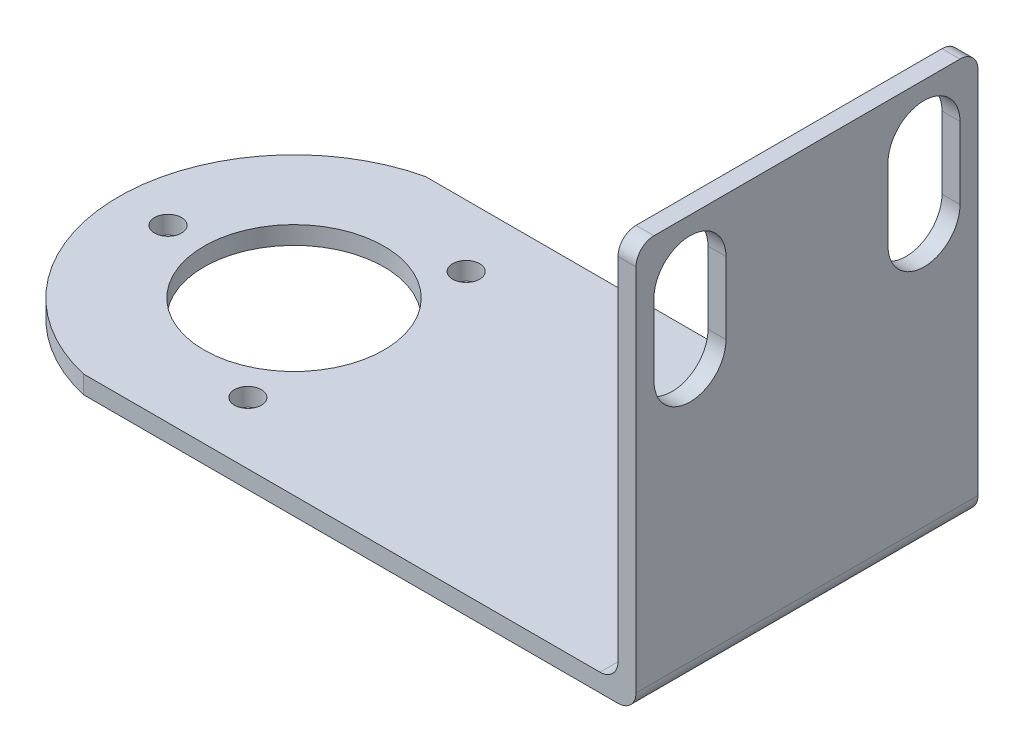
ISO-10303-21;
HEADER;
FILE_DESCRIPTION(('STEP AP214'),'2;1');
FILE_NAME('part.step','',(''),(''),'','','');
FILE_SCHEMA(('AUTOMOTIVE_DESIGN { 1 0 10303 214 1 1 1 1 }'));
ENDSEC;
DATA;
#1=APPLICATION_CONTEXT('core data for automotive mechanical design processes');
#2=APPLICATION_PROTOCOL_DEFINITION('international standard','automotive_design',2000,#1);
#3=PRODUCT_CONTEXT('',#1,'mechanical');
#4=PRODUCT('Part','Part','',(#3));
#5=PRODUCT_RELATED_PRODUCT_CATEGORY('part','',(#4));
#6=PRODUCT_DEFINITION_FORMATION('','',#4);
#7=PRODUCT_DEFINITION_CONTEXT('part definition',#1,'design');
#8=PRODUCT_DEFINITION('design','',#6,#7);
#9=PRODUCT_DEFINITION_SHAPE('','',#8);
#10=(LENGTH_UNIT() NAMED_UNIT(*) SI_UNIT(.MILLI.,.METRE.));
#11=(NAMED_UNIT(*) PLANE_ANGLE_UNIT() SI_UNIT($,.RADIAN.));
#12=(NAMED_UNIT(*) SI_UNIT($,.STERADIAN.) SOLID_ANGLE_UNIT());
#13=UNCERTAINTY_MEASURE_WITH_UNIT(LENGTH_MEASURE(1.E-05),#10,'distance_accuracy_value','');
#14=(GEOMETRIC_REPRESENTATION_CONTEXT(3) GLOBAL_UNCERTAINTY_ASSIGNED_CONTEXT((#13)) GLOBAL_UNIT_ASSIGNED_CONTEXT((#10,
#11,#12)) REPRESENTATION_CONTEXT('',''));
#15=CARTESIAN_POINT('',(0.,0.,0.));
#16=DIRECTION('',(0.,0.,1.));
#17=DIRECTION('',(1.,0.,0.));
#18=AXIS2_PLACEMENT_3D('',#15,#16,#17);
#19=CARTESIAN_POINT('',(0.,2.,-38.));
#20=DIRECTION('',(0.,0.,-1.));
#21=DIRECTION('',(-1.,0.,0.));
#22=AXIS2_PLACEMENT_3D('',#19,#20,#21);
#23=PLANE('',#22);
#24=DIRECTION('',(0.,-1.,0.));
#25=VECTOR('',#24,1.);
#26=CARTESIAN_POINT('',(59.3874821936961,45.,-38.));
#27=LINE('',#26,#25);
#28=CARTESIAN_POINT('',(59.3874821936961,43.,-38.));
#29=VERTEX_POINT('',#28);
#30=CARTESIAN_POINT('',(59.3874821936961,4.,-38.));
#31=VERTEX_POINT('',#30);
#32=EDGE_CURVE('E220',#29,#31,#27,.T.);
#33=ORIENTED_EDGE('',*,*,#32,.F.);
#34=DIRECTION('',(-1.,0.,0.));
#35=VECTOR('',#34,1.);
#36=CARTESIAN_POINT('',(0.,43.,-38.));
#37=LINE('',#36,#35);
#38=CARTESIAN_POINT('',(61.3874821936961,43.,-38.));
#39=VERTEX_POINT('',#38);
#40=EDGE_CURVE('E302',#29,#39,#37,.F.);
#41=ORIENTED_EDGE('',*,*,#40,.T.);
#42=DIRECTION('',(0.,-1.,0.));
#43=VECTOR('',#42,1.);
#44=CARTESIAN_POINT('',(61.3874821936961,2.,-38.));
#45=LINE('',#44,#43);
#46=CARTESIAN_POINT('',(61.3874821936961,2.,-38.));
#47=VERTEX_POINT('',#46);
#48=EDGE_CURVE('E246',#39,#47,#45,.T.);
#49=ORIENTED_EDGE('',*,*,#48,.T.);
#50=CARTESIAN_POINT('',(59.3874821936961,2.,-38.));
#51=DIRECTION('',(0.,0.,-1.));
#52=DIRECTION('',(-1.,0.,0.));
#53=AXIS2_PLACEMENT_3D('',#50,#51,#52);
#54=CIRCLE('',#53,2.);
#55=CARTESIAN_POINT('',(59.3874821936961,0.,-38.));
#56=VERTEX_POINT('',#55);
#57=EDGE_CURVE('E300',#47,#56,#54,.T.);
#58=ORIENTED_EDGE('',*,*,#57,.T.);
#59=DIRECTION('',(1.,0.,0.));
#60=VECTOR('',#59,1.);
#61=CARTESIAN_POINT('',(0.,0.,-38.));
#62=LINE('',#61,#60);
#63=CARTESIAN_POINT('',(0.,0.,-38.));
#64=VERTEX_POINT('',#63);
#65=EDGE_CURVE('E258',#64,#56,#62,.T.);
#66=ORIENTED_EDGE('',*,*,#65,.F.);
#67=DIRECTION('',(0.,-1.,0.));
#68=VECTOR('',#67,1.);
#69=CARTESIAN_POINT('',(0.,2.,-38.));
#70=LINE('',#69,#68);
#71=CARTESIAN_POINT('',(0.,2.,-38.));
#72=VERTEX_POINT('',#71);
#73=EDGE_CURVE('E274',#72,#64,#70,.T.);
#74=ORIENTED_EDGE('',*,*,#73,.F.);
#75=DIRECTION('',(1.,0.,0.));
#76=VECTOR('',#75,1.);
#77=CARTESIAN_POINT('',(0.,2.,-38.));
#78=LINE('',#77,#76);
#79=CARTESIAN_POINT('',(57.3874821936961,2.,-38.));
#80=VERTEX_POINT('',#79);
#81=EDGE_CURVE('E237',#72,#80,#78,.T.);
#82=ORIENTED_EDGE('',*,*,#81,.T.);
#83=CARTESIAN_POINT('',(57.3874821936961,4.,-38.));
#84=DIRECTION('',(0.,0.,-1.));
#85=DIRECTION('',(-1.,0.,0.));
#86=AXIS2_PLACEMENT_3D('',#83,#84,#85);
#87=CIRCLE('',#86,2.);
#88=EDGE_CURVE('E310',#80,#31,#87,.F.);
#89=ORIENTED_EDGE('',*,*,#88,.T.);
#90=EDGE_LOOP('',(#33,#41,#49,#58,#66,#74,#82,#89));
#91=FACE_BOUND('',#90,.T.);
#92=ADVANCED_FACE('F35',(#91),#23,.T.);
#93=CARTESIAN_POINT('',(4.38748219369606,2.,-19.));
#94=DIRECTION('',(0.,-1.,0.));
#95=DIRECTION('',(0.,0.,-1.));
#96=AXIS2_PLACEMENT_3D('',#93,#94,#95);
#97=CYLINDRICAL_SURFACE('',#96,19.5);
#98=CARTESIAN_POINT('',(4.38748219369606,0.,-19.));
#99=DIRECTION('',(0.,1.,0.));
#100=DIRECTION('',(0.,0.,1.));
#101=AXIS2_PLACEMENT_3D('',#98,#99,#100);
#102=CIRCLE('',#101,19.5);
#103=CARTESIAN_POINT('',(0.,0.,0.));
#104=VERTEX_POINT('',#103);
#105=EDGE_CURVE('E261',#64,#104,#102,.T.);
#106=ORIENTED_EDGE('',*,*,#105,.T.);
#107=DIRECTION('',(0.,-1.,0.));
#108=VECTOR('',#107,1.);
#109=CARTESIAN_POINT('',(0.,2.,0.));
#110=LINE('',#109,#108);
#111=CARTESIAN_POINT('',(0.,2.,0.));
#112=VERTEX_POINT('',#111);
#113=EDGE_CURVE('E271',#112,#104,#110,.T.);
#114=ORIENTED_EDGE('',*,*,#113,.F.);
#115=CARTESIAN_POINT('',(4.38748219369606,2.,-19.));
#116=DIRECTION('',(0.,1.,0.));
#117=DIRECTION('',(0.,0.,1.));
#118=AXIS2_PLACEMENT_3D('',#115,#116,#117);
#119=CIRCLE('',#118,19.5);
#120=EDGE_CURVE('E240',#72,#112,#119,.T.);
#121=ORIENTED_EDGE('',*,*,#120,.F.);
#122=ORIENTED_EDGE('',*,*,#73,.T.);
#123=EDGE_LOOP('',(#106,#114,#121,#122));
#124=FACE_BOUND('',#123,.T.);
#125=ADVANCED_FACE('F348',(#124),#97,.T.);
#126=CARTESIAN_POINT('',(0.,2.,0.));
#127=DIRECTION('',(0.,0.,-1.));
#128=DIRECTION('',(-1.,0.,0.));
#129=AXIS2_PLACEMENT_3D('',#126,#127,#128);
#130=PLANE('',#129);
#131=DIRECTION('',(0.,-1.,0.));
#132=VECTOR('',#131,1.);
#133=CARTESIAN_POINT('',(61.3874821936961,2.,0.));
#134=LINE('',#133,#132);
#135=CARTESIAN_POINT('',(61.3874821936961,43.,0.));
#136=VERTEX_POINT('',#135);
#137=CARTESIAN_POINT('',(61.3874821936961,2.,0.));
#138=VERTEX_POINT('',#137);
#139=EDGE_CURVE('E268',#136,#138,#134,.T.);
#140=ORIENTED_EDGE('',*,*,#139,.F.);
#141=DIRECTION('',(1.,0.,0.));
#142=VECTOR('',#141,1.);
#143=CARTESIAN_POINT('',(59.3874821936961,43.,0.));
#144=LINE('',#143,#142);
#145=CARTESIAN_POINT('',(59.3874821936961,43.,0.));
#146=VERTEX_POINT('',#145);
#147=EDGE_CURVE('E291',#136,#146,#144,.F.);
#148=ORIENTED_EDGE('',*,*,#147,.T.);
#149=DIRECTION('',(0.,-1.,0.));
#150=VECTOR('',#149,1.);
#151=CARTESIAN_POINT('',(59.3874821936961,45.,0.));
#152=LINE('',#151,#150);
#153=CARTESIAN_POINT('',(59.3874821936961,4.,0.));
#154=VERTEX_POINT('',#153);
#155=EDGE_CURVE('E217',#146,#154,#152,.T.);
#156=ORIENTED_EDGE('',*,*,#155,.T.);
#157=CARTESIAN_POINT('',(57.3874821936961,4.,0.));
#158=DIRECTION('',(0.,0.,-1.));
#159=DIRECTION('',(-1.,0.,0.));
#160=AXIS2_PLACEMENT_3D('',#157,#158,#159);
#161=CIRCLE('',#160,2.);
#162=CARTESIAN_POINT('',(57.3874821936961,2.,0.));
#163=VERTEX_POINT('',#162);
#164=EDGE_CURVE('E308',#154,#163,#161,.T.);
#165=ORIENTED_EDGE('',*,*,#164,.T.);
#166=DIRECTION('',(1.,0.,0.));
#167=VECTOR('',#166,1.);
#168=CARTESIAN_POINT('',(0.,2.,0.));
#169=LINE('',#168,#167);
#170=EDGE_CURVE('E243',#112,#163,#169,.T.);
#171=ORIENTED_EDGE('',*,*,#170,.F.);
#172=ORIENTED_EDGE('',*,*,#113,.T.);
#173=DIRECTION('',(1.,0.,0.));
#174=VECTOR('',#173,1.);
#175=CARTESIAN_POINT('',(0.,0.,0.));
#176=LINE('',#175,#174);
#177=CARTESIAN_POINT('',(59.3874821936961,0.,0.));
#178=VERTEX_POINT('',#177);
#179=EDGE_CURVE('E228',#104,#178,#176,.T.);
#180=ORIENTED_EDGE('',*,*,#179,.T.);
#181=CARTESIAN_POINT('',(59.3874821936961,2.,0.));
#182=DIRECTION('',(0.,0.,-1.));
#183=DIRECTION('',(-1.,0.,0.));
#184=AXIS2_PLACEMENT_3D('',#181,#182,#183);
#185=CIRCLE('',#184,2.);
#186=EDGE_CURVE('E289',#178,#138,#185,.F.);
#187=ORIENTED_EDGE('',*,*,#186,.T.);
#188=EDGE_LOOP('',(#140,#148,#156,#165,#171,#172,#180,#187));
#189=FACE_BOUND('',#188,.T.);
#190=ADVANCED_FACE('F354',(#189),#130,.F.);
#191=CARTESIAN_POINT('',(-9.61251780630394,2.,-19.));
#192=DIRECTION('',(0.,-1.,0.));
#193=DIRECTION('',(0.,0.,-1.));
#194=AXIS2_PLACEMENT_3D('',#191,#192,#193);
#195=CYLINDRICAL_SURFACE('',#194,1.5);
#196=CARTESIAN_POINT('',(-9.61251780630394,2.,-19.));
#197=DIRECTION('',(0.,1.,0.));
#198=DIRECTION('',(0.,0.,1.));
#199=AXIS2_PLACEMENT_3D('',#196,#197,#198);
#200=CIRCLE('',#199,1.5);
#201=CARTESIAN_POINT('',(-9.61251780630394,2.,-17.5));
#202=VERTEX_POINT('',#201);
#203=EDGE_CURVE('E234',#202,#202,#200,.T.);
#204=ORIENTED_EDGE('',*,*,#203,.T.);
#205=EDGE_LOOP('',(#204));
#206=FACE_BOUND('',#205,.T.);
#207=CARTESIAN_POINT('',(-9.61251780630394,0.,-19.));
#208=DIRECTION('',(0.,1.,0.));
#209=DIRECTION('',(0.,0.,1.));
#210=AXIS2_PLACEMENT_3D('',#207,#208,#209);
#211=CIRCLE('',#210,1.5);
#212=CARTESIAN_POINT('',(-9.61251780630394,0.,-17.5));
#213=VERTEX_POINT('',#212);
#214=EDGE_CURVE('E255',#213,#213,#211,.T.);
#215=ORIENTED_EDGE('',*,*,#214,.F.);
#216=EDGE_LOOP('',(#215));
#217=FACE_BOUND('',#216,.T.);
#218=ADVANCED_FACE('F360',(#206,#217),#195,.F.);
#219=CARTESIAN_POINT('',(11.3874821936961,2.,-31.1243556529821));
#220=DIRECTION('',(0.,-1.,0.));
#221=DIRECTION('',(0.,0.,-1.));
#222=AXIS2_PLACEMENT_3D('',#219,#220,#221);
#223=CYLINDRICAL_SURFACE('',#222,1.5);
#224=CARTESIAN_POINT('',(11.3874821936961,2.,-31.1243556529821));
#225=DIRECTION('',(0.,1.,0.));
#226=DIRECTION('',(0.,0.,1.));
#227=AXIS2_PLACEMENT_3D('',#224,#225,#226);
#228=CIRCLE('',#227,1.5);
#229=CARTESIAN_POINT('',(11.3874821936961,2.,-29.6243556529821));
#230=VERTEX_POINT('',#229);
#231=EDGE_CURVE('E231',#230,#230,#228,.T.);
#232=ORIENTED_EDGE('',*,*,#231,.T.);
#233=EDGE_LOOP('',(#232));
#234=FACE_BOUND('',#233,.T.);
#235=CARTESIAN_POINT('',(11.3874821936961,0.,-31.1243556529821));
#236=DIRECTION('',(0.,1.,0.));
#237=DIRECTION('',(0.,0.,1.));
#238=AXIS2_PLACEMENT_3D('',#235,#236,#237);
#239=CIRCLE('',#238,1.5);
#240=CARTESIAN_POINT('',(11.3874821936961,0.,-29.6243556529821));
#241=VERTEX_POINT('',#240);
#242=EDGE_CURVE('E252',#241,#241,#239,.T.);
#243=ORIENTED_EDGE('',*,*,#242,.F.);
#244=EDGE_LOOP('',(#243));
#245=FACE_BOUND('',#244,.T.);
#246=ADVANCED_FACE('F363',(#234,#245),#223,.F.);
#247=CARTESIAN_POINT('',(11.3874821936961,2.,-6.87564434701786));
#248=DIRECTION('',(0.,-1.,0.));
#249=DIRECTION('',(0.,0.,-1.));
#250=AXIS2_PLACEMENT_3D('',#247,#248,#249);
#251=CYLINDRICAL_SURFACE('',#250,1.5);
#252=CARTESIAN_POINT('',(11.3874821936961,2.,-6.87564434701786));
#253=DIRECTION('',(0.,1.,0.));
#254=DIRECTION('',(0.,0.,1.));
#255=AXIS2_PLACEMENT_3D('',#252,#253,#254);
#256=CIRCLE('',#255,1.5);
#257=CARTESIAN_POINT('',(11.3874821936961,2.,-5.37564434701786));
#258=VERTEX_POINT('',#257);
#259=EDGE_CURVE('E227',#258,#258,#256,.T.);
#260=ORIENTED_EDGE('',*,*,#259,.T.);
#261=EDGE_LOOP('',(#260));
#262=FACE_BOUND('',#261,.T.);
#263=CARTESIAN_POINT('',(11.3874821936961,0.,-6.87564434701786));
#264=DIRECTION('',(0.,1.,0.));
#265=DIRECTION('',(0.,0.,1.));
#266=AXIS2_PLACEMENT_3D('',#263,#264,#265);
#267=CIRCLE('',#266,1.5);
#268=CARTESIAN_POINT('',(11.3874821936961,0.,-5.37564434701786));
#269=VERTEX_POINT('',#268);
#270=EDGE_CURVE('E249',#269,#269,#267,.T.);
#271=ORIENTED_EDGE('',*,*,#270,.F.);
#272=EDGE_LOOP('',(#271));
#273=FACE_BOUND('',#272,.T.);
#274=ADVANCED_FACE('F367',(#262,#273),#251,.F.);
#275=CARTESIAN_POINT('',(4.38748219369606,2.,-19.));
#276=DIRECTION('',(0.,-1.,0.));
#277=DIRECTION('',(0.,0.,-1.));
#278=AXIS2_PLACEMENT_3D('',#275,#276,#277);
#279=CYLINDRICAL_SURFACE('',#278,10.);
#280=CARTESIAN_POINT('',(4.38748219369606,2.,-19.));
#281=DIRECTION('',(0.,1.,0.));
#282=DIRECTION('',(0.,0.,1.));
#283=AXIS2_PLACEMENT_3D('',#280,#281,#282);
#284=CIRCLE('',#283,10.);
#285=CARTESIAN_POINT('',(4.38748219369606,2.,-9.));
#286=VERTEX_POINT('',#285);
#287=EDGE_CURVE('E224',#286,#286,#284,.T.);
#288=ORIENTED_EDGE('',*,*,#287,.T.);
#289=EDGE_LOOP('',(#288));
#290=FACE_BOUND('',#289,.T.);
#291=CARTESIAN_POINT('',(4.38748219369606,0.,-19.));
#292=DIRECTION('',(0.,1.,0.));
#293=DIRECTION('',(0.,0.,1.));
#294=AXIS2_PLACEMENT_3D('',#291,#292,#293);
#295=CIRCLE('',#294,10.);
#296=CARTESIAN_POINT('',(4.38748219369606,0.,-9.));
#297=VERTEX_POINT('',#296);
#298=EDGE_CURVE('E223',#297,#297,#295,.T.);
#299=ORIENTED_EDGE('',*,*,#298,.F.);
#300=EDGE_LOOP('',(#299));
#301=FACE_BOUND('',#300,.T.);
#302=ADVANCED_FACE('F371',(#290,#301),#279,.F.);
#303=CARTESIAN_POINT('',(61.3874821936961,2.,0.));
#304=DIRECTION('',(-1.,0.,0.));
#305=DIRECTION('',(0.,0.,1.));
#306=AXIS2_PLACEMENT_3D('',#303,#304,#305);
#307=PLANE('',#306);
#308=DIRECTION('',(0.,-1.,0.));
#309=VECTOR('',#308,1.);
#310=CARTESIAN_POINT('',(61.3874821936961,39.,-2.));
#311=LINE('',#310,#309);
#312=CARTESIAN_POINT('',(61.3874821936961,39.,-2.));
#313=VERTEX_POINT('',#312);
#314=CARTESIAN_POINT('',(61.3874821936961,31.,-2.));
#315=VERTEX_POINT('',#314);
#316=EDGE_CURVE('E177',#313,#315,#311,.T.);
#317=ORIENTED_EDGE('',*,*,#316,.F.);
#318=CARTESIAN_POINT('',(61.3874821936961,39.,-6.));
#319=DIRECTION('',(1.,0.,0.));
#320=DIRECTION('',(0.,0.,-1.));
#321=AXIS2_PLACEMENT_3D('',#318,#319,#320);
#322=CIRCLE('',#321,4.);
#323=CARTESIAN_POINT('',(61.3874821936961,39.,-10.));
#324=VERTEX_POINT('',#323);
#325=EDGE_CURVE('E50',#324,#313,#322,.T.);
#326=ORIENTED_EDGE('',*,*,#325,.F.);
#327=DIRECTION('',(0.,1.,0.));
#328=VECTOR('',#327,1.);
#329=CARTESIAN_POINT('',(61.3874821936961,39.,-10.));
#330=LINE('',#329,#328);
#331=CARTESIAN_POINT('',(61.3874821936961,31.,-10.));
#332=VERTEX_POINT('',#331);
#333=EDGE_CURVE('E184',#332,#324,#330,.T.);
#334=ORIENTED_EDGE('',*,*,#333,.F.);
#335=CARTESIAN_POINT('',(61.3874821936961,31.,-6.));
#336=DIRECTION('',(1.,0.,0.));
#337=DIRECTION('',(0.,0.,-1.));
#338=AXIS2_PLACEMENT_3D('',#335,#336,#337);
#339=CIRCLE('',#338,4.);
#340=EDGE_CURVE('E167',#315,#332,#339,.T.);
#341=ORIENTED_EDGE('',*,*,#340,.F.);
#342=EDGE_LOOP('',(#317,#326,#334,#341));
#343=FACE_BOUND('',#342,.T.);
#344=DIRECTION('',(0.,-1.,0.));
#345=VECTOR('',#344,1.);
#346=CARTESIAN_POINT('',(61.3874821936961,39.,-28.));
#347=LINE('',#346,#345);
#348=CARTESIAN_POINT('',(61.3874821936961,39.,-28.));
#349=VERTEX_POINT('',#348);
#350=CARTESIAN_POINT('',(61.3874821936961,31.,-28.));
#351=VERTEX_POINT('',#350);
#352=EDGE_CURVE('E195',#349,#351,#347,.T.);
#353=ORIENTED_EDGE('',*,*,#352,.F.);
#354=CARTESIAN_POINT('',(61.3874821936961,39.,-32.));
#355=DIRECTION('',(1.,0.,0.));
#356=DIRECTION('',(0.,0.,-1.));
#357=AXIS2_PLACEMENT_3D('',#354,#355,#356);
#358=CIRCLE('',#357,4.);
#359=CARTESIAN_POINT('',(61.3874821936961,39.,-36.));
#360=VERTEX_POINT('',#359);
#361=EDGE_CURVE('E58',#360,#349,#358,.T.);
#362=ORIENTED_EDGE('',*,*,#361,.F.);
#363=DIRECTION('',(0.,1.,0.));
#364=VECTOR('',#363,1.);
#365=CARTESIAN_POINT('',(61.3874821936961,39.,-36.));
#366=LINE('',#365,#364);
#367=CARTESIAN_POINT('',(61.3874821936961,31.,-36.));
#368=VERTEX_POINT('',#367);
#369=EDGE_CURVE('E201',#368,#360,#366,.T.);
#370=ORIENTED_EDGE('',*,*,#369,.F.);
#371=CARTESIAN_POINT('',(61.3874821936961,31.,-32.));
#372=DIRECTION('',(1.,0.,0.));
#373=DIRECTION('',(0.,0.,-1.));
#374=AXIS2_PLACEMENT_3D('',#371,#372,#373);
#375=CIRCLE('',#374,4.);
#376=EDGE_CURVE('E198',#351,#368,#375,.T.);
#377=ORIENTED_EDGE('',*,*,#376,.F.);
#378=EDGE_LOOP('',(#353,#362,#370,#377));
#379=FACE_BOUND('',#378,.T.);
#380=DIRECTION('',(0.,0.,-1.));
#381=VECTOR('',#380,1.);
#382=CARTESIAN_POINT('',(61.3874821936961,45.,0.));
#383=LINE('',#382,#381);
#384=CARTESIAN_POINT('',(61.3874821936961,45.,-2.));
#385=VERTEX_POINT('',#384);
#386=CARTESIAN_POINT('',(61.3874821936961,45.,-36.));
#387=VERTEX_POINT('',#386);
#388=EDGE_CURVE('E191',#385,#387,#383,.T.);
#389=ORIENTED_EDGE('',*,*,#388,.F.);
#390=CARTESIAN_POINT('',(61.3874821936961,43.,-2.));
#391=DIRECTION('',(-1.,0.,0.));
#392=DIRECTION('',(0.,0.,1.));
#393=AXIS2_PLACEMENT_3D('',#390,#391,#392);
#394=CIRCLE('',#393,2.);
#395=EDGE_CURVE('E287',#385,#136,#394,.F.);
#396=ORIENTED_EDGE('',*,*,#395,.T.);
#397=ORIENTED_EDGE('',*,*,#139,.T.);
#398=DIRECTION('',(0.,0.,-1.));
#399=VECTOR('',#398,1.);
#400=CARTESIAN_POINT('',(61.3874821936961,2.,0.));
#401=LINE('',#400,#399);
#402=EDGE_CURVE('E282',#138,#47,#401,.T.);
#403=ORIENTED_EDGE('',*,*,#402,.T.);
#404=ORIENTED_EDGE('',*,*,#48,.F.);
#405=CARTESIAN_POINT('',(61.3874821936961,43.,-36.));
#406=DIRECTION('',(-1.,0.,0.));
#407=DIRECTION('',(0.,0.,1.));
#408=AXIS2_PLACEMENT_3D('',#405,#406,#407);
#409=CIRCLE('',#408,2.);
#410=EDGE_CURVE('E285',#39,#387,#409,.F.);
#411=ORIENTED_EDGE('',*,*,#410,.T.);
#412=EDGE_LOOP('',(#389,#396,#397,#403,#404,#411));
#413=FACE_BOUND('',#412,.T.);
#414=ADVANCED_FACE('F181',(#343,#379,#413),#307,.F.);
#415=CARTESIAN_POINT('',(0.,2.,0.));
#416=DIRECTION('',(0.,1.,0.));
#417=DIRECTION('',(0.,0.,1.));
#418=AXIS2_PLACEMENT_3D('',#415,#416,#417);
#419=PLANE('',#418);
#420=ORIENTED_EDGE('',*,*,#170,.T.);
#421=DIRECTION('',(0.,0.,1.));
#422=VECTOR('',#421,1.);
#423=CARTESIAN_POINT('',(57.3874821936961,2.,0.));
#424=LINE('',#423,#422);
#425=EDGE_CURVE('E304',#163,#80,#424,.F.);
#426=ORIENTED_EDGE('',*,*,#425,.T.);
#427=ORIENTED_EDGE('',*,*,#81,.F.);
#428=ORIENTED_EDGE('',*,*,#120,.T.);
#429=EDGE_LOOP('',(#420,#426,#427,#428));
#430=FACE_BOUND('',#429,.T.);
#431=ORIENTED_EDGE('',*,*,#287,.F.);
#432=EDGE_LOOP('',(#431));
#433=FACE_BOUND('',#432,.T.);
#434=ORIENTED_EDGE('',*,*,#259,.F.);
#435=EDGE_LOOP('',(#434));
#436=FACE_BOUND('',#435,.T.);
#437=ORIENTED_EDGE('',*,*,#231,.F.);
#438=EDGE_LOOP('',(#437));
#439=FACE_BOUND('',#438,.T.);
#440=ORIENTED_EDGE('',*,*,#203,.F.);
#441=EDGE_LOOP('',(#440));
#442=FACE_BOUND('',#441,.T.);
#443=ADVANCED_FACE('F420',(#430,#433,#436,#439,#442),#419,.T.);
#444=CARTESIAN_POINT('',(0.,0.,0.));
#445=DIRECTION('',(0.,1.,0.));
#446=DIRECTION('',(0.,0.,1.));
#447=AXIS2_PLACEMENT_3D('',#444,#445,#446);
#448=PLANE('',#447);
#449=ORIENTED_EDGE('',*,*,#298,.T.);
#450=EDGE_LOOP('',(#449));
#451=FACE_BOUND('',#450,.T.);
#452=ORIENTED_EDGE('',*,*,#270,.T.);
#453=EDGE_LOOP('',(#452));
#454=FACE_BOUND('',#453,.T.);
#455=ORIENTED_EDGE('',*,*,#242,.T.);
#456=EDGE_LOOP('',(#455));
#457=FACE_BOUND('',#456,.T.);
#458=ORIENTED_EDGE('',*,*,#214,.T.);
#459=EDGE_LOOP('',(#458));
#460=FACE_BOUND('',#459,.T.);
#461=ORIENTED_EDGE('',*,*,#65,.T.);
#462=DIRECTION('',(0.,0.,-1.));
#463=VECTOR('',#462,1.);
#464=CARTESIAN_POINT('',(59.3874821936961,0.,0.));
#465=LINE('',#464,#463);
#466=EDGE_CURVE('E306',#56,#178,#465,.F.);
#467=ORIENTED_EDGE('',*,*,#466,.T.);
#468=ORIENTED_EDGE('',*,*,#179,.F.);
#469=ORIENTED_EDGE('',*,*,#105,.F.);
#470=EDGE_LOOP('',(#461,#467,#468,#469));
#471=FACE_BOUND('',#470,.T.);
#472=ADVANCED_FACE('F413',(#451,#454,#457,#460,#471),#448,.F.);
#473=CARTESIAN_POINT('',(59.3874821936961,45.,0.));
#474=DIRECTION('',(1.,0.,0.));
#475=DIRECTION('',(0.,0.,-1.));
#476=AXIS2_PLACEMENT_3D('',#473,#474,#475);
#477=PLANE('',#476);
#478=DIRECTION('',(0.,1.,0.));
#479=VECTOR('',#478,1.);
#480=CARTESIAN_POINT('',(59.3874821936961,45.,-10.));
#481=LINE('',#480,#479);
#482=CARTESIAN_POINT('',(59.3874821936961,31.,-10.));
#483=VERTEX_POINT('',#482);
#484=CARTESIAN_POINT('',(59.3874821936961,39.,-10.));
#485=VERTEX_POINT('',#484);
#486=EDGE_CURVE('E43',#483,#485,#481,.T.);
#487=ORIENTED_EDGE('',*,*,#486,.T.);
#488=CARTESIAN_POINT('',(59.3874821936961,39.,-6.));
#489=DIRECTION('',(1.,0.,0.));
#490=DIRECTION('',(0.,0.,-1.));
#491=AXIS2_PLACEMENT_3D('',#488,#489,#490);
#492=CIRCLE('',#491,4.);
#493=CARTESIAN_POINT('',(59.3874821936961,39.,-2.));
#494=VERTEX_POINT('',#493);
#495=EDGE_CURVE('E11',#485,#494,#492,.T.);
#496=ORIENTED_EDGE('',*,*,#495,.T.);
#497=DIRECTION('',(0.,-1.,0.));
#498=VECTOR('',#497,1.);
#499=CARTESIAN_POINT('',(59.3874821936961,45.,-2.));
#500=LINE('',#499,#498);
#501=CARTESIAN_POINT('',(59.3874821936961,31.,-2.));
#502=VERTEX_POINT('',#501);
#503=EDGE_CURVE('E324',#494,#502,#500,.T.);
#504=ORIENTED_EDGE('',*,*,#503,.T.);
#505=CARTESIAN_POINT('',(59.3874821936961,31.,-6.));
#506=DIRECTION('',(1.,0.,0.));
#507=DIRECTION('',(0.,0.,-1.));
#508=AXIS2_PLACEMENT_3D('',#505,#506,#507);
#509=CIRCLE('',#508,4.);
#510=EDGE_CURVE('E170',#502,#483,#509,.T.);
#511=ORIENTED_EDGE('',*,*,#510,.T.);
#512=EDGE_LOOP('',(#487,#496,#504,#511));
#513=FACE_BOUND('',#512,.T.);
#514=DIRECTION('',(0.,1.,0.));
#515=VECTOR('',#514,1.);
#516=CARTESIAN_POINT('',(59.3874821936961,45.,-36.));
#517=LINE('',#516,#515);
#518=CARTESIAN_POINT('',(59.3874821936961,31.,-36.));
#519=VERTEX_POINT('',#518);
#520=CARTESIAN_POINT('',(59.3874821936961,39.,-36.));
#521=VERTEX_POINT('',#520);
#522=EDGE_CURVE('E318',#519,#521,#517,.T.);
#523=ORIENTED_EDGE('',*,*,#522,.T.);
#524=CARTESIAN_POINT('',(59.3874821936961,39.,-32.));
#525=DIRECTION('',(1.,0.,0.));
#526=DIRECTION('',(0.,0.,-1.));
#527=AXIS2_PLACEMENT_3D('',#524,#525,#526);
#528=CIRCLE('',#527,4.);
#529=CARTESIAN_POINT('',(59.3874821936961,39.,-28.));
#530=VERTEX_POINT('',#529);
#531=EDGE_CURVE('E321',#521,#530,#528,.T.);
#532=ORIENTED_EDGE('',*,*,#531,.T.);
#533=DIRECTION('',(0.,-1.,0.));
#534=VECTOR('',#533,1.);
#535=CARTESIAN_POINT('',(59.3874821936961,45.,-28.));
#536=LINE('',#535,#534);
#537=CARTESIAN_POINT('',(59.3874821936961,31.,-28.));
#538=VERTEX_POINT('',#537);
#539=EDGE_CURVE('E312',#530,#538,#536,.T.);
#540=ORIENTED_EDGE('',*,*,#539,.T.);
#541=CARTESIAN_POINT('',(59.3874821936961,31.,-32.));
#542=DIRECTION('',(1.,0.,0.));
#543=DIRECTION('',(0.,0.,-1.));
#544=AXIS2_PLACEMENT_3D('',#541,#542,#543);
#545=CIRCLE('',#544,4.);
#546=EDGE_CURVE('E315',#538,#519,#545,.T.);
#547=ORIENTED_EDGE('',*,*,#546,.T.);
#548=EDGE_LOOP('',(#523,#532,#540,#547));
#549=FACE_BOUND('',#548,.T.);
#550=ORIENTED_EDGE('',*,*,#155,.F.);
#551=CARTESIAN_POINT('',(59.3874821936961,43.,-2.));
#552=DIRECTION('',(1.,0.,0.));
#553=DIRECTION('',(0.,0.,-1.));
#554=AXIS2_PLACEMENT_3D('',#551,#552,#553);
#555=CIRCLE('',#554,2.);
#556=CARTESIAN_POINT('',(59.3874821936961,45.,-2.));
#557=VERTEX_POINT('',#556);
#558=EDGE_CURVE('E298',#146,#557,#555,.F.);
#559=ORIENTED_EDGE('',*,*,#558,.T.);
#560=DIRECTION('',(0.,0.,1.));
#561=VECTOR('',#560,1.);
#562=CARTESIAN_POINT('',(59.3874821936961,45.,0.));
#563=LINE('',#562,#561);
#564=CARTESIAN_POINT('',(59.3874821936961,45.,-36.));
#565=VERTEX_POINT('',#564);
#566=EDGE_CURVE('E214',#565,#557,#563,.T.);
#567=ORIENTED_EDGE('',*,*,#566,.F.);
#568=CARTESIAN_POINT('',(59.3874821936961,43.,-36.));
#569=DIRECTION('',(1.,0.,0.));
#570=DIRECTION('',(0.,0.,-1.));
#571=AXIS2_PLACEMENT_3D('',#568,#569,#570);
#572=CIRCLE('',#571,2.);
#573=EDGE_CURVE('E296',#565,#29,#572,.F.);
#574=ORIENTED_EDGE('',*,*,#573,.T.);
#575=ORIENTED_EDGE('',*,*,#32,.T.);
#576=DIRECTION('',(0.,0.,1.));
#577=VECTOR('',#576,1.);
#578=CARTESIAN_POINT('',(59.3874821936961,4.,0.));
#579=LINE('',#578,#577);
#580=EDGE_CURVE('E293',#31,#154,#579,.T.);
#581=ORIENTED_EDGE('',*,*,#580,.T.);
#582=EDGE_LOOP('',(#550,#559,#567,#574,#575,#581));
#583=FACE_BOUND('',#582,.T.);
#584=ADVANCED_FACE('F328',(#513,#549,#583),#477,.F.);
#585=CARTESIAN_POINT('',(0.,45.,0.));
#586=DIRECTION('',(0.,1.,0.));
#587=DIRECTION('',(0.,0.,1.));
#588=AXIS2_PLACEMENT_3D('',#585,#586,#587);
#589=PLANE('',#588);
#590=ORIENTED_EDGE('',*,*,#566,.T.);
#591=DIRECTION('',(1.,0.,0.));
#592=VECTOR('',#591,1.);
#593=CARTESIAN_POINT('',(61.3874821936961,45.,-2.));
#594=LINE('',#593,#592);
#595=EDGE_CURVE('E279',#557,#385,#594,.T.);
#596=ORIENTED_EDGE('',*,*,#595,.T.);
#597=ORIENTED_EDGE('',*,*,#388,.T.);
#598=DIRECTION('',(-1.,0.,0.));
#599=VECTOR('',#598,1.);
#600=CARTESIAN_POINT('',(0.,45.,-36.));
#601=LINE('',#600,#599);
#602=EDGE_CURVE('E276',#387,#565,#601,.T.);
#603=ORIENTED_EDGE('',*,*,#602,.T.);
#604=EDGE_LOOP('',(#590,#596,#597,#603));
#605=FACE_BOUND('',#604,.T.);
#606=ADVANCED_FACE('F380',(#605),#589,.T.);
#607=CARTESIAN_POINT('',(0.,43.,-2.));
#608=DIRECTION('',(-1.,0.,0.));
#609=DIRECTION('',(0.,0.,1.));
#610=AXIS2_PLACEMENT_3D('',#607,#608,#609);
#611=CYLINDRICAL_SURFACE('',#610,2.);
#612=ORIENTED_EDGE('',*,*,#558,.F.);
#613=ORIENTED_EDGE('',*,*,#147,.F.);
#614=ORIENTED_EDGE('',*,*,#395,.F.);
#615=ORIENTED_EDGE('',*,*,#595,.F.);
#616=EDGE_LOOP('',(#612,#613,#614,#615));
#617=FACE_BOUND('',#616,.T.);
#618=ADVANCED_FACE('F376',(#617),#611,.T.);
#619=CARTESIAN_POINT('',(0.,43.,-36.));
#620=DIRECTION('',(-1.,0.,0.));
#621=DIRECTION('',(0.,0.,1.));
#622=AXIS2_PLACEMENT_3D('',#619,#620,#621);
#623=CYLINDRICAL_SURFACE('',#622,2.);
#624=ORIENTED_EDGE('',*,*,#410,.F.);
#625=ORIENTED_EDGE('',*,*,#40,.F.);
#626=ORIENTED_EDGE('',*,*,#573,.F.);
#627=ORIENTED_EDGE('',*,*,#602,.F.);
#628=EDGE_LOOP('',(#624,#625,#626,#627));
#629=FACE_BOUND('',#628,.T.);
#630=ADVANCED_FACE('F379',(#629),#623,.T.);
#631=CARTESIAN_POINT('',(57.3874821936961,4.,0.));
#632=DIRECTION('',(0.,0.,1.));
#633=DIRECTION('',(1.,0.,0.));
#634=AXIS2_PLACEMENT_3D('',#631,#632,#633);
#635=CYLINDRICAL_SURFACE('',#634,2.);
#636=ORIENTED_EDGE('',*,*,#88,.F.);
#637=ORIENTED_EDGE('',*,*,#425,.F.);
#638=ORIENTED_EDGE('',*,*,#164,.F.);
#639=ORIENTED_EDGE('',*,*,#580,.F.);
#640=EDGE_LOOP('',(#636,#637,#638,#639));
#641=FACE_BOUND('',#640,.T.);
#642=ADVANCED_FACE('F383',(#641),#635,.F.);
#643=CARTESIAN_POINT('',(59.3874821936961,2.,0.));
#644=DIRECTION('',(0.,0.,-1.));
#645=DIRECTION('',(-1.,0.,0.));
#646=AXIS2_PLACEMENT_3D('',#643,#644,#645);
#647=CYLINDRICAL_SURFACE('',#646,2.);
#648=ORIENTED_EDGE('',*,*,#186,.F.);
#649=ORIENTED_EDGE('',*,*,#466,.F.);
#650=ORIENTED_EDGE('',*,*,#57,.F.);
#651=ORIENTED_EDGE('',*,*,#402,.F.);
#652=EDGE_LOOP('',(#648,#649,#650,#651));
#653=FACE_BOUND('',#652,.T.);
#654=ADVANCED_FACE('F37',(#653),#647,.T.);
#655=CARTESIAN_POINT('',(-15.1125178063039,39.,-32.));
#656=DIRECTION('',(1.,0.,0.));
#657=DIRECTION('',(0.,0.,-1.));
#658=AXIS2_PLACEMENT_3D('',#655,#656,#657);
#659=CYLINDRICAL_SURFACE('',#658,4.);
#660=DIRECTION('',(1.,0.,0.));
#661=VECTOR('',#660,1.);
#662=CARTESIAN_POINT('',(-15.1125178063039,39.,-36.));
#663=LINE('',#662,#661);
#664=EDGE_CURVE('E205',#521,#360,#663,.T.);
#665=ORIENTED_EDGE('',*,*,#664,.T.);
#666=ORIENTED_EDGE('',*,*,#361,.T.);
#667=DIRECTION('',(1.,0.,0.));
#668=VECTOR('',#667,1.);
#669=CARTESIAN_POINT('',(-15.1125178063039,39.,-28.));
#670=LINE('',#669,#668);
#671=EDGE_CURVE('E204',#530,#349,#670,.T.);
#672=ORIENTED_EDGE('',*,*,#671,.F.);
#673=ORIENTED_EDGE('',*,*,#531,.F.);
#674=EDGE_LOOP('',(#665,#666,#672,#673));
#675=FACE_BOUND('',#674,.T.);
#676=ADVANCED_FACE('F390',(#675),#659,.F.);
#677=CARTESIAN_POINT('',(-15.1125178063039,39.,-36.));
#678=DIRECTION('',(0.,0.,-1.));
#679=DIRECTION('',(-1.,0.,0.));
#680=AXIS2_PLACEMENT_3D('',#677,#678,#679);
#681=PLANE('',#680);
#682=DIRECTION('',(1.,0.,0.));
#683=VECTOR('',#682,1.);
#684=CARTESIAN_POINT('',(-15.1125178063039,31.,-36.));
#685=LINE('',#684,#683);
#686=EDGE_CURVE('E207',#519,#368,#685,.T.);
#687=ORIENTED_EDGE('',*,*,#686,.T.);
#688=ORIENTED_EDGE('',*,*,#369,.T.);
#689=ORIENTED_EDGE('',*,*,#664,.F.);
#690=ORIENTED_EDGE('',*,*,#522,.F.);
#691=EDGE_LOOP('',(#687,#688,#689,#690));
#692=FACE_BOUND('',#691,.T.);
#693=ADVANCED_FACE('F520',(#692),#681,.F.);
#694=CARTESIAN_POINT('',(-15.1125178063039,31.,-32.));
#695=DIRECTION('',(1.,0.,0.));
#696=DIRECTION('',(0.,0.,-1.));
#697=AXIS2_PLACEMENT_3D('',#694,#695,#696);
#698=CYLINDRICAL_SURFACE('',#697,4.);
#699=DIRECTION('',(1.,0.,0.));
#700=VECTOR('',#699,1.);
#701=CARTESIAN_POINT('',(-15.1125178063039,31.,-28.));
#702=LINE('',#701,#700);
#703=EDGE_CURVE('E209',#538,#351,#702,.T.);
#704=ORIENTED_EDGE('',*,*,#703,.T.);
#705=ORIENTED_EDGE('',*,*,#376,.T.);
#706=ORIENTED_EDGE('',*,*,#686,.F.);
#707=ORIENTED_EDGE('',*,*,#546,.F.);
#708=EDGE_LOOP('',(#704,#705,#706,#707));
#709=FACE_BOUND('',#708,.T.);
#710=ADVANCED_FACE('F342',(#709),#698,.F.);
#711=CARTESIAN_POINT('',(-15.1125178063039,39.,-28.));
#712=DIRECTION('',(0.,0.,1.));
#713=DIRECTION('',(1.,0.,0.));
#714=AXIS2_PLACEMENT_3D('',#711,#712,#713);
#715=PLANE('',#714);
#716=ORIENTED_EDGE('',*,*,#671,.T.);
#717=ORIENTED_EDGE('',*,*,#352,.T.);
#718=ORIENTED_EDGE('',*,*,#703,.F.);
#719=ORIENTED_EDGE('',*,*,#539,.F.);
#720=EDGE_LOOP('',(#716,#717,#718,#719));
#721=FACE_BOUND('',#720,.T.);
#722=ADVANCED_FACE('F335',(#721),#715,.F.);
#723=CARTESIAN_POINT('',(-15.1125178063039,39.,-6.));
#724=DIRECTION('',(1.,0.,0.));
#725=DIRECTION('',(0.,0.,-1.));
#726=AXIS2_PLACEMENT_3D('',#723,#724,#725);
#727=CYLINDRICAL_SURFACE('',#726,4.);
#728=DIRECTION('',(1.,0.,0.));
#729=VECTOR('',#728,1.);
#730=CARTESIAN_POINT('',(-15.1125178063039,39.,-10.));
#731=LINE('',#730,#729);
#732=EDGE_CURVE('E189',#485,#324,#731,.T.);
#733=ORIENTED_EDGE('',*,*,#732,.T.);
#734=ORIENTED_EDGE('',*,*,#325,.T.);
#735=DIRECTION('',(1.,0.,0.));
#736=VECTOR('',#735,1.);
#737=CARTESIAN_POINT('',(-15.1125178063039,39.,-2.));
#738=LINE('',#737,#736);
#739=EDGE_CURVE('E174',#494,#313,#738,.T.);
#740=ORIENTED_EDGE('',*,*,#739,.F.);
#741=ORIENTED_EDGE('',*,*,#495,.F.);
#742=EDGE_LOOP('',(#733,#734,#740,#741));
#743=FACE_BOUND('',#742,.T.);
#744=ADVANCED_FACE('F333',(#743),#727,.F.);
#745=CARTESIAN_POINT('',(-15.1125178063039,39.,-10.));
#746=DIRECTION('',(0.,0.,-1.));
#747=DIRECTION('',(0.,1.,0.));
#748=AXIS2_PLACEMENT_3D('',#745,#746,#747);
#749=PLANE('',#748);
#750=DIRECTION('',(1.,0.,0.));
#751=VECTOR('',#750,1.);
#752=CARTESIAN_POINT('',(-15.1125178063039,31.,-10.));
#753=LINE('',#752,#751);
#754=EDGE_CURVE('E173',#483,#332,#753,.T.);
#755=ORIENTED_EDGE('',*,*,#754,.T.);
#756=ORIENTED_EDGE('',*,*,#333,.T.);
#757=ORIENTED_EDGE('',*,*,#732,.F.);
#758=ORIENTED_EDGE('',*,*,#486,.F.);
#759=EDGE_LOOP('',(#755,#756,#757,#758));
#760=FACE_BOUND('',#759,.T.);
#761=ADVANCED_FACE('F332',(#760),#749,.F.);
#762=CARTESIAN_POINT('',(-15.1125178063039,31.,-6.));
#763=DIRECTION('',(1.,0.,0.));
#764=DIRECTION('',(0.,0.,-1.));
#765=AXIS2_PLACEMENT_3D('',#762,#763,#764);
#766=CYLINDRICAL_SURFACE('',#765,4.);
#767=DIRECTION('',(1.,0.,0.));
#768=VECTOR('',#767,1.);
#769=CARTESIAN_POINT('',(-15.1125178063039,31.,-2.));
#770=LINE('',#769,#768);
#771=EDGE_CURVE('E162',#502,#315,#770,.T.);
#772=ORIENTED_EDGE('',*,*,#771,.T.);
#773=ORIENTED_EDGE('',*,*,#340,.T.);
#774=ORIENTED_EDGE('',*,*,#754,.F.);
#775=ORIENTED_EDGE('',*,*,#510,.F.);
#776=EDGE_LOOP('',(#772,#773,#774,#775));
#777=FACE_BOUND('',#776,.T.);
#778=ADVANCED_FACE('F164',(#777),#766,.F.);
#779=CARTESIAN_POINT('',(-15.1125178063039,39.,-2.));
#780=DIRECTION('',(0.,0.,1.));
#781=DIRECTION('',(1.,0.,0.));
#782=AXIS2_PLACEMENT_3D('',#779,#780,#781);
#783=PLANE('',#782);
#784=ORIENTED_EDGE('',*,*,#739,.T.);
#785=ORIENTED_EDGE('',*,*,#316,.T.);
#786=ORIENTED_EDGE('',*,*,#771,.F.);
#787=ORIENTED_EDGE('',*,*,#503,.F.);
#788=EDGE_LOOP('',(#784,#785,#786,#787));
#789=FACE_BOUND('',#788,.T.);
#790=ADVANCED_FACE('F178',(#789),#783,.F.);
#791=CLOSED_SHELL('',(#92,#125,#190,#218,#246,#274,#302,#414,#443,#472,#584,#606,#618,#630,#642,
#654,#676,#693,#710,#722,#744,#761,#778,#790));
#792=MANIFOLD_SOLID_BREP('B2',#791);
#793=ADVANCED_BREP_SHAPE_REPRESENTATION('',(#18,#792),#14);
#794=SHAPE_DEFINITION_REPRESENTATION(#9,#793);
ENDSEC;
END-ISO-10303-21;
